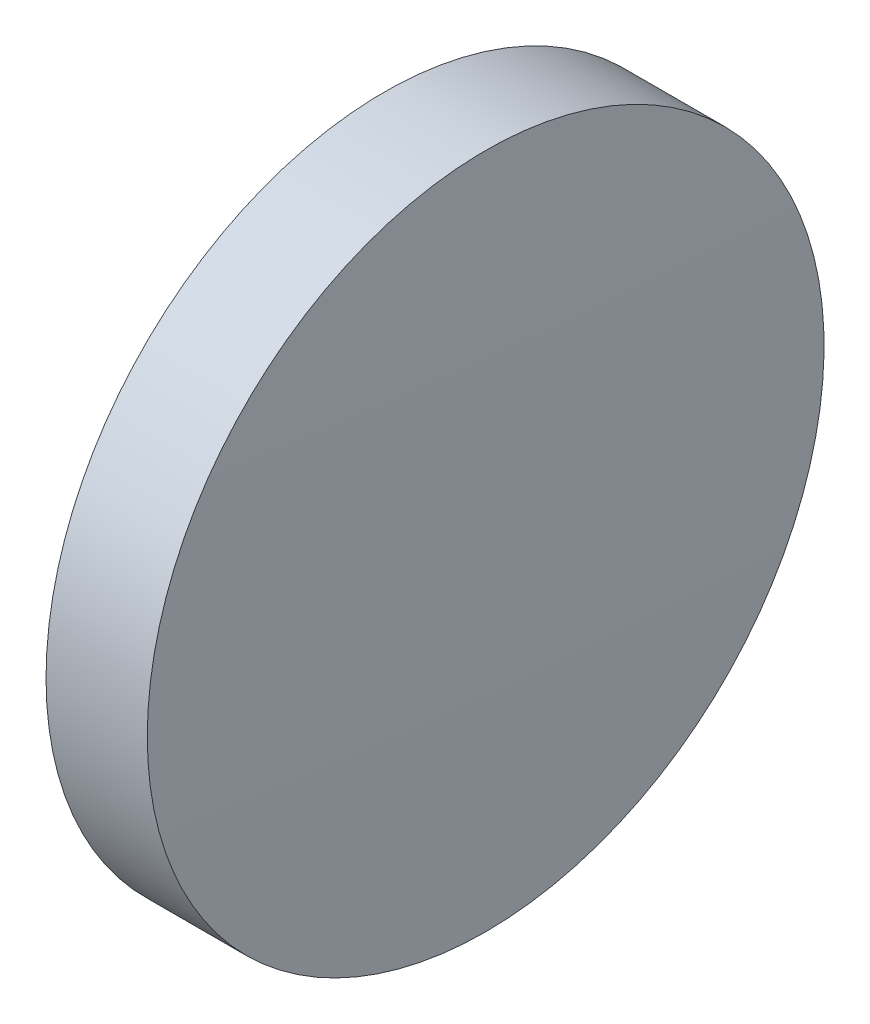
ISO-10303-21;
HEADER;
FILE_DESCRIPTION(('STEP AP214'),'2;1');
FILE_NAME('part.step','',(''),(''),'','','');
FILE_SCHEMA(('AUTOMOTIVE_DESIGN { 1 0 10303 214 1 1 1 1 }'));
ENDSEC;
DATA;
#1=APPLICATION_CONTEXT('core data for automotive mechanical design processes');
#2=APPLICATION_PROTOCOL_DEFINITION('international standard','automotive_design',2000,#1);
#3=PRODUCT_CONTEXT('',#1,'mechanical');
#4=PRODUCT('Part','Part','',(#3));
#5=PRODUCT_RELATED_PRODUCT_CATEGORY('part','',(#4));
#6=PRODUCT_DEFINITION_FORMATION('','',#4);
#7=PRODUCT_DEFINITION_CONTEXT('part definition',#1,'design');
#8=PRODUCT_DEFINITION('design','',#6,#7);
#9=PRODUCT_DEFINITION_SHAPE('','',#8);
#10=(LENGTH_UNIT() NAMED_UNIT(*) SI_UNIT(.MILLI.,.METRE.));
#11=(NAMED_UNIT(*) PLANE_ANGLE_UNIT() SI_UNIT($,.RADIAN.));
#12=(NAMED_UNIT(*) SI_UNIT($,.STERADIAN.) SOLID_ANGLE_UNIT());
#13=UNCERTAINTY_MEASURE_WITH_UNIT(LENGTH_MEASURE(1.E-05),#10,'distance_accuracy_value','');
#14=(GEOMETRIC_REPRESENTATION_CONTEXT(3) GLOBAL_UNCERTAINTY_ASSIGNED_CONTEXT((#13)) GLOBAL_UNIT_ASSIGNED_CONTEXT((#10,
#11,#12)) REPRESENTATION_CONTEXT('',''));
#15=CARTESIAN_POINT('',(0.,0.,0.));
#16=DIRECTION('',(0.,0.,1.));
#17=DIRECTION('',(1.,0.,0.));
#18=AXIS2_PLACEMENT_3D('',#15,#16,#17);
#19=CARTESIAN_POINT('',(-283.560444523808,65.2335549264127,0.));
#20=DIRECTION('',(-1.,0.,0.));
#21=DIRECTION('',(0.,-1.,0.));
#22=AXIS2_PLACEMENT_3D('',#19,#20,#21);
#23=SPHERICAL_SURFACE('',#22,403.325000000009);
#24=CARTESIAN_POINT('',(119.564555476201,65.2335549264122,0.));
#25=DIRECTION('',(-1.,0.,0.));
#26=DIRECTION('',(0.,0.,1.));
#27=AXIS2_PLACEMENT_3D('',#24,#25,#26);
#28=CIRCLE('',#27,12.7);
#29=CARTESIAN_POINT('',(119.564555476201,65.2335549264122,12.7));
#30=VERTEX_POINT('',#29);
#31=EDGE_CURVE('E10',#30,#30,#28,.T.);
#32=ORIENTED_EDGE('',*,*,#31,.F.);
#33=EDGE_LOOP('',(#32));
#34=FACE_BOUND('',#33,.T.);
#35=ADVANCED_FACE('F35',(#34),#23,.T.);
#36=CARTESIAN_POINT('',(110.165373228488,65.2335549264122,0.));
#37=DIRECTION('',(-1.,0.,0.));
#38=DIRECTION('',(0.,0.,1.));
#39=AXIS2_PLACEMENT_3D('',#36,#37,#38);
#40=CYLINDRICAL_SURFACE('',#39,12.7);
#41=CARTESIAN_POINT('',(115.764555476201,65.2335549264122,0.));
#42=DIRECTION('',(-1.,0.,0.));
#43=DIRECTION('',(0.,0.,1.));
#44=AXIS2_PLACEMENT_3D('',#41,#42,#43);
#45=CIRCLE('',#44,12.7);
#46=CARTESIAN_POINT('',(115.764555476201,65.2335549264122,12.7));
#47=VERTEX_POINT('',#46);
#48=EDGE_CURVE('E41',#47,#47,#45,.T.);
#49=ORIENTED_EDGE('',*,*,#48,.F.);
#50=EDGE_LOOP('',(#49));
#51=FACE_BOUND('',#50,.T.);
#52=ORIENTED_EDGE('',*,*,#31,.T.);
#53=EDGE_LOOP('',(#52));
#54=FACE_BOUND('',#53,.T.);
#55=ADVANCED_FACE('F49',(#51,#54),#40,.T.);
#56=CARTESIAN_POINT('',(115.764555476201,65.2335549264122,0.));
#57=DIRECTION('',(1.,0.,0.));
#58=DIRECTION('',(0.,0.,-1.));
#59=AXIS2_PLACEMENT_3D('',#56,#57,#58);
#60=PLANE('',#59);
#61=ORIENTED_EDGE('',*,*,#48,.T.);
#62=EDGE_LOOP('',(#61));
#63=FACE_BOUND('',#62,.T.);
#64=ADVANCED_FACE('F47',(#63),#60,.F.);
#65=CLOSED_SHELL('',(#35,#55,#64));
#66=MANIFOLD_SOLID_BREP('B2',#65);
#67=ADVANCED_BREP_SHAPE_REPRESENTATION('',(#18,#66),#14);
#68=SHAPE_DEFINITION_REPRESENTATION(#9,#67);
ENDSEC;
END-ISO-10303-21;
